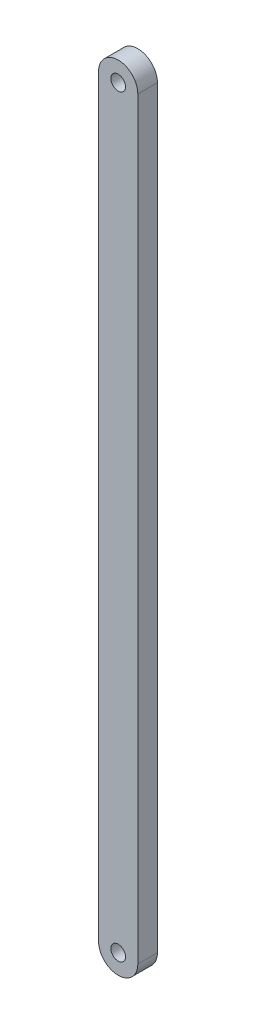
ISO-10303-21;
HEADER;
FILE_DESCRIPTION(('STEP AP214'),'2;1');
FILE_NAME('part.step','',(''),(''),'','','');
FILE_SCHEMA(('AUTOMOTIVE_DESIGN { 1 0 10303 214 1 1 1 1 }'));
ENDSEC;
DATA;
#1=APPLICATION_CONTEXT('core data for automotive mechanical design processes');
#2=APPLICATION_PROTOCOL_DEFINITION('international standard','automotive_design',2000,#1);
#3=PRODUCT_CONTEXT('',#1,'mechanical');
#4=PRODUCT('Part','Part','',(#3));
#5=PRODUCT_RELATED_PRODUCT_CATEGORY('part','',(#4));
#6=PRODUCT_DEFINITION_FORMATION('','',#4);
#7=PRODUCT_DEFINITION_CONTEXT('part definition',#1,'design');
#8=PRODUCT_DEFINITION('design','',#6,#7);
#9=PRODUCT_DEFINITION_SHAPE('','',#8);
#10=(LENGTH_UNIT() NAMED_UNIT(*) SI_UNIT(.MILLI.,.METRE.));
#11=(NAMED_UNIT(*) PLANE_ANGLE_UNIT() SI_UNIT($,.RADIAN.));
#12=(NAMED_UNIT(*) SI_UNIT($,.STERADIAN.) SOLID_ANGLE_UNIT());
#13=UNCERTAINTY_MEASURE_WITH_UNIT(LENGTH_MEASURE(1.E-05),#10,'distance_accuracy_value','');
#14=(GEOMETRIC_REPRESENTATION_CONTEXT(3) GLOBAL_UNCERTAINTY_ASSIGNED_CONTEXT((#13)) GLOBAL_UNIT_ASSIGNED_CONTEXT((#10,
#11,#12)) REPRESENTATION_CONTEXT('',''));
#15=CARTESIAN_POINT('',(0.,0.,0.));
#16=DIRECTION('',(0.,0.,1.));
#17=DIRECTION('',(1.,0.,0.));
#18=AXIS2_PLACEMENT_3D('',#15,#16,#17);
#19=CARTESIAN_POINT('',(0.,243.84,12.7));
#20=DIRECTION('',(0.,0.,1.));
#21=DIRECTION('',(1.,0.,0.));
#22=AXIS2_PLACEMENT_3D('',#19,#20,#21);
#23=PLANE('',#22);
#24=CARTESIAN_POINT('',(0.,243.84,12.7));
#25=DIRECTION('',(0.,0.,1.));
#26=DIRECTION('',(1.,0.,0.));
#27=AXIS2_PLACEMENT_3D('',#24,#25,#26);
#28=CIRCLE('',#27,4.7625);
#29=CARTESIAN_POINT('',(4.7624999999999,243.84,12.7));
#30=VERTEX_POINT('',#29);
#31=EDGE_CURVE('E100',#30,#30,#28,.T.);
#32=ORIENTED_EDGE('',*,*,#31,.F.);
#33=EDGE_LOOP('',(#32));
#34=FACE_BOUND('',#33,.T.);
#35=CARTESIAN_POINT('',(0.,243.84,12.7));
#36=DIRECTION('',(0.,0.,1.));
#37=DIRECTION('',(1.,0.,0.));
#38=AXIS2_PLACEMENT_3D('',#35,#36,#37);
#39=CIRCLE('',#38,12.7);
#40=CARTESIAN_POINT('',(12.6999999999999,243.84,12.7));
#41=VERTEX_POINT('',#40);
#42=CARTESIAN_POINT('',(-12.7000000000001,243.84,12.7));
#43=VERTEX_POINT('',#42);
#44=EDGE_CURVE('E85',#41,#43,#39,.T.);
#45=ORIENTED_EDGE('',*,*,#44,.T.);
#46=DIRECTION('',(0.,-1.,0.));
#47=VECTOR('',#46,1.);
#48=CARTESIAN_POINT('',(-12.7000000000001,243.84,12.7));
#49=LINE('',#48,#47);
#50=CARTESIAN_POINT('',(-12.7,-243.84,12.7));
#51=VERTEX_POINT('',#50);
#52=EDGE_CURVE('E80',#43,#51,#49,.T.);
#53=ORIENTED_EDGE('',*,*,#52,.T.);
#54=CARTESIAN_POINT('',(0.,-243.84,12.7));
#55=DIRECTION('',(0.,0.,1.));
#56=DIRECTION('',(1.,0.,0.));
#57=AXIS2_PLACEMENT_3D('',#54,#55,#56);
#58=CIRCLE('',#57,12.7);
#59=CARTESIAN_POINT('',(12.7000000000001,-243.84,12.7));
#60=VERTEX_POINT('',#59);
#61=EDGE_CURVE('E83',#51,#60,#58,.T.);
#62=ORIENTED_EDGE('',*,*,#61,.T.);
#63=DIRECTION('',(0.,1.,0.));
#64=VECTOR('',#63,1.);
#65=CARTESIAN_POINT('',(12.6999999999999,243.84,12.7));
#66=LINE('',#65,#64);
#67=EDGE_CURVE('E50',#60,#41,#66,.T.);
#68=ORIENTED_EDGE('',*,*,#67,.T.);
#69=EDGE_LOOP('',(#45,#53,#62,#68));
#70=FACE_BOUND('',#69,.T.);
#71=CARTESIAN_POINT('',(0.,-243.84,12.7));
#72=DIRECTION('',(0.,0.,1.));
#73=DIRECTION('',(1.,0.,0.));
#74=AXIS2_PLACEMENT_3D('',#71,#72,#73);
#75=CIRCLE('',#74,4.7625);
#76=CARTESIAN_POINT('',(4.7625,-243.84,12.7));
#77=VERTEX_POINT('',#76);
#78=EDGE_CURVE('E115',#77,#77,#75,.T.);
#79=ORIENTED_EDGE('',*,*,#78,.F.);
#80=EDGE_LOOP('',(#79));
#81=FACE_BOUND('',#80,.T.);
#82=ADVANCED_FACE('F33',(#34,#70,#81),#23,.T.);
#83=CARTESIAN_POINT('',(0.,243.84,0.));
#84=DIRECTION('',(0.,0.,1.));
#85=DIRECTION('',(1.,0.,0.));
#86=AXIS2_PLACEMENT_3D('',#83,#84,#85);
#87=PLANE('',#86);
#88=CARTESIAN_POINT('',(0.,243.84,0.));
#89=DIRECTION('',(0.,0.,1.));
#90=DIRECTION('',(1.,0.,0.));
#91=AXIS2_PLACEMENT_3D('',#88,#89,#90);
#92=CIRCLE('',#91,12.7);
#93=CARTESIAN_POINT('',(12.6999999999999,243.84,0.));
#94=VERTEX_POINT('',#93);
#95=CARTESIAN_POINT('',(-12.7000000000001,243.84,0.));
#96=VERTEX_POINT('',#95);
#97=EDGE_CURVE('E97',#94,#96,#92,.T.);
#98=ORIENTED_EDGE('',*,*,#97,.F.);
#99=DIRECTION('',(0.,1.,0.));
#100=VECTOR('',#99,1.);
#101=CARTESIAN_POINT('',(12.6999999999999,243.84,0.));
#102=LINE('',#101,#100);
#103=CARTESIAN_POINT('',(12.7000000000001,-243.84,0.));
#104=VERTEX_POINT('',#103);
#105=EDGE_CURVE('E73',#104,#94,#102,.T.);
#106=ORIENTED_EDGE('',*,*,#105,.F.);
#107=CARTESIAN_POINT('',(0.,-243.84,0.));
#108=DIRECTION('',(0.,0.,1.));
#109=DIRECTION('',(1.,0.,0.));
#110=AXIS2_PLACEMENT_3D('',#107,#108,#109);
#111=CIRCLE('',#110,12.7);
#112=CARTESIAN_POINT('',(-12.7,-243.84,0.));
#113=VERTEX_POINT('',#112);
#114=EDGE_CURVE('E67',#113,#104,#111,.T.);
#115=ORIENTED_EDGE('',*,*,#114,.F.);
#116=DIRECTION('',(0.,-1.,0.));
#117=VECTOR('',#116,1.);
#118=CARTESIAN_POINT('',(-12.7000000000001,243.84,0.));
#119=LINE('',#118,#117);
#120=EDGE_CURVE('E89',#96,#113,#119,.T.);
#121=ORIENTED_EDGE('',*,*,#120,.F.);
#122=EDGE_LOOP('',(#98,#106,#115,#121));
#123=FACE_BOUND('',#122,.T.);
#124=CARTESIAN_POINT('',(0.,243.84,0.));
#125=DIRECTION('',(0.,0.,1.));
#126=DIRECTION('',(1.,0.,0.));
#127=AXIS2_PLACEMENT_3D('',#124,#125,#126);
#128=CIRCLE('',#127,4.7625);
#129=CARTESIAN_POINT('',(4.7624999999999,243.84,0.));
#130=VERTEX_POINT('',#129);
#131=EDGE_CURVE('E112',#130,#130,#128,.T.);
#132=ORIENTED_EDGE('',*,*,#131,.T.);
#133=EDGE_LOOP('',(#132));
#134=FACE_BOUND('',#133,.T.);
#135=CARTESIAN_POINT('',(0.,-243.84,0.));
#136=DIRECTION('',(0.,0.,1.));
#137=DIRECTION('',(1.,0.,0.));
#138=AXIS2_PLACEMENT_3D('',#135,#136,#137);
#139=CIRCLE('',#138,4.7625);
#140=CARTESIAN_POINT('',(4.7625,-243.84,0.));
#141=VERTEX_POINT('',#140);
#142=EDGE_CURVE('E118',#141,#141,#139,.T.);
#143=ORIENTED_EDGE('',*,*,#142,.T.);
#144=EDGE_LOOP('',(#143));
#145=FACE_BOUND('',#144,.T.);
#146=ADVANCED_FACE('F108',(#123,#134,#145),#87,.F.);
#147=CARTESIAN_POINT('',(0.,243.84,12.7));
#148=DIRECTION('',(0.,0.,-1.));
#149=DIRECTION('',(-1.,0.,0.));
#150=AXIS2_PLACEMENT_3D('',#147,#148,#149);
#151=CYLINDRICAL_SURFACE('',#150,12.7);
#152=ORIENTED_EDGE('',*,*,#97,.T.);
#153=DIRECTION('',(0.,0.,-1.));
#154=VECTOR('',#153,1.);
#155=CARTESIAN_POINT('',(-12.7000000000001,243.84,12.7));
#156=LINE('',#155,#154);
#157=EDGE_CURVE('E11',#43,#96,#156,.T.);
#158=ORIENTED_EDGE('',*,*,#157,.F.);
#159=ORIENTED_EDGE('',*,*,#44,.F.);
#160=DIRECTION('',(0.,0.,-1.));
#161=VECTOR('',#160,1.);
#162=CARTESIAN_POINT('',(12.6999999999999,243.84,12.7));
#163=LINE('',#162,#161);
#164=EDGE_CURVE('E93',#41,#94,#163,.T.);
#165=ORIENTED_EDGE('',*,*,#164,.T.);
#166=EDGE_LOOP('',(#152,#158,#159,#165));
#167=FACE_BOUND('',#166,.T.);
#168=ADVANCED_FACE('F35',(#167),#151,.T.);
#169=CARTESIAN_POINT('',(-12.7000000000001,243.84,12.7));
#170=DIRECTION('',(1.,0.,0.));
#171=DIRECTION('',(0.,1.,0.));
#172=AXIS2_PLACEMENT_3D('',#169,#170,#171);
#173=PLANE('',#172);
#174=ORIENTED_EDGE('',*,*,#120,.T.);
#175=DIRECTION('',(0.,0.,-1.));
#176=VECTOR('',#175,1.);
#177=CARTESIAN_POINT('',(-12.7,-243.84,12.7));
#178=LINE('',#177,#176);
#179=EDGE_CURVE('E42',#51,#113,#178,.T.);
#180=ORIENTED_EDGE('',*,*,#179,.F.);
#181=ORIENTED_EDGE('',*,*,#52,.F.);
#182=ORIENTED_EDGE('',*,*,#157,.T.);
#183=EDGE_LOOP('',(#174,#180,#181,#182));
#184=FACE_BOUND('',#183,.T.);
#185=ADVANCED_FACE('F88',(#184),#173,.F.);
#186=CARTESIAN_POINT('',(0.,-243.84,12.7));
#187=DIRECTION('',(0.,0.,-1.));
#188=DIRECTION('',(-1.,0.,0.));
#189=AXIS2_PLACEMENT_3D('',#186,#187,#188);
#190=CYLINDRICAL_SURFACE('',#189,12.7);
#191=ORIENTED_EDGE('',*,*,#114,.T.);
#192=DIRECTION('',(0.,0.,-1.));
#193=VECTOR('',#192,1.);
#194=CARTESIAN_POINT('',(12.7000000000001,-243.84,12.7));
#195=LINE('',#194,#193);
#196=EDGE_CURVE('E90',#60,#104,#195,.T.);
#197=ORIENTED_EDGE('',*,*,#196,.F.);
#198=ORIENTED_EDGE('',*,*,#61,.F.);
#199=ORIENTED_EDGE('',*,*,#179,.T.);
#200=EDGE_LOOP('',(#191,#197,#198,#199));
#201=FACE_BOUND('',#200,.T.);
#202=ADVANCED_FACE('F91',(#201),#190,.T.);
#203=CARTESIAN_POINT('',(12.6999999999999,243.84,12.7));
#204=DIRECTION('',(-1.,0.,0.));
#205=DIRECTION('',(0.,-1.,0.));
#206=AXIS2_PLACEMENT_3D('',#203,#204,#205);
#207=PLANE('',#206);
#208=ORIENTED_EDGE('',*,*,#105,.T.);
#209=ORIENTED_EDGE('',*,*,#164,.F.);
#210=ORIENTED_EDGE('',*,*,#67,.F.);
#211=ORIENTED_EDGE('',*,*,#196,.T.);
#212=EDGE_LOOP('',(#208,#209,#210,#211));
#213=FACE_BOUND('',#212,.T.);
#214=ADVANCED_FACE('F105',(#213),#207,.F.);
#215=CARTESIAN_POINT('',(0.,243.84,12.7));
#216=DIRECTION('',(0.,0.,-1.));
#217=DIRECTION('',(-1.,0.,0.));
#218=AXIS2_PLACEMENT_3D('',#215,#216,#217);
#219=CYLINDRICAL_SURFACE('',#218,4.7625);
#220=ORIENTED_EDGE('',*,*,#31,.T.);
#221=EDGE_LOOP('',(#220));
#222=FACE_BOUND('',#221,.T.);
#223=ORIENTED_EDGE('',*,*,#131,.F.);
#224=EDGE_LOOP('',(#223));
#225=FACE_BOUND('',#224,.T.);
#226=ADVANCED_FACE('F135',(#222,#225),#219,.F.);
#227=CARTESIAN_POINT('',(0.,-243.84,12.7));
#228=DIRECTION('',(0.,0.,-1.));
#229=DIRECTION('',(-1.,0.,0.));
#230=AXIS2_PLACEMENT_3D('',#227,#228,#229);
#231=CYLINDRICAL_SURFACE('',#230,4.7625);
#232=ORIENTED_EDGE('',*,*,#78,.T.);
#233=EDGE_LOOP('',(#232));
#234=FACE_BOUND('',#233,.T.);
#235=ORIENTED_EDGE('',*,*,#142,.F.);
#236=EDGE_LOOP('',(#235));
#237=FACE_BOUND('',#236,.T.);
#238=ADVANCED_FACE('F124',(#234,#237),#231,.F.);
#239=CLOSED_SHELL('',(#82,#146,#168,#185,#202,#214,#226,#238));
#240=MANIFOLD_SOLID_BREP('B2',#239);
#241=ADVANCED_BREP_SHAPE_REPRESENTATION('',(#18,#240),#14);
#242=SHAPE_DEFINITION_REPRESENTATION(#9,#241);
ENDSEC;
END-ISO-10303-21;
